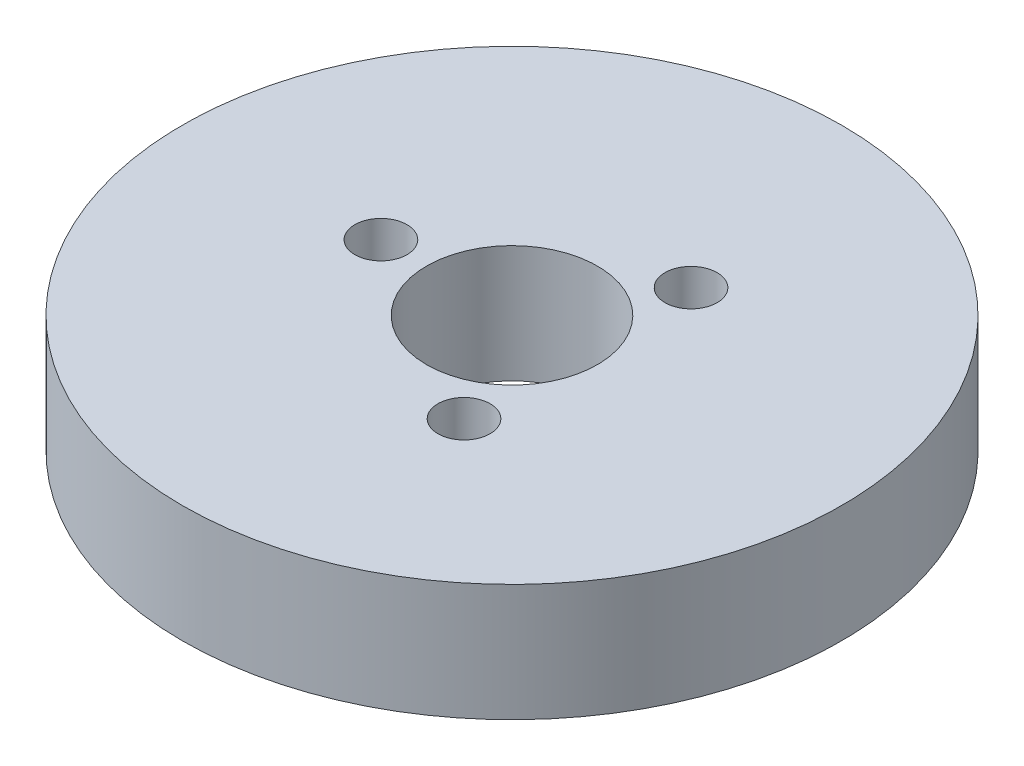
ISO-10303-21;
HEADER;
FILE_DESCRIPTION(('STEP AP214'),'2;1');
FILE_NAME('part.step','',(''),(''),'','','');
FILE_SCHEMA(('AUTOMOTIVE_DESIGN { 1 0 10303 214 1 1 1 1 }'));
ENDSEC;
DATA;
#1=APPLICATION_CONTEXT('core data for automotive mechanical design processes');
#2=APPLICATION_PROTOCOL_DEFINITION('international standard','automotive_design',2000,#1);
#3=PRODUCT_CONTEXT('',#1,'mechanical');
#4=PRODUCT('Part','Part','',(#3));
#5=PRODUCT_RELATED_PRODUCT_CATEGORY('part','',(#4));
#6=PRODUCT_DEFINITION_FORMATION('','',#4);
#7=PRODUCT_DEFINITION_CONTEXT('part definition',#1,'design');
#8=PRODUCT_DEFINITION('design','',#6,#7);
#9=PRODUCT_DEFINITION_SHAPE('','',#8);
#10=(LENGTH_UNIT() NAMED_UNIT(*) SI_UNIT(.MILLI.,.METRE.));
#11=(NAMED_UNIT(*) PLANE_ANGLE_UNIT() SI_UNIT($,.RADIAN.));
#12=(NAMED_UNIT(*) SI_UNIT($,.STERADIAN.) SOLID_ANGLE_UNIT());
#13=UNCERTAINTY_MEASURE_WITH_UNIT(LENGTH_MEASURE(1.E-05),#10,'distance_accuracy_value','');
#14=(GEOMETRIC_REPRESENTATION_CONTEXT(3) GLOBAL_UNCERTAINTY_ASSIGNED_CONTEXT((#13)) GLOBAL_UNIT_ASSIGNED_CONTEXT((#10,
#11,#12)) REPRESENTATION_CONTEXT('',''));
#15=CARTESIAN_POINT('',(0.,0.,0.));
#16=DIRECTION('',(0.,0.,1.));
#17=DIRECTION('',(1.,0.,0.));
#18=AXIS2_PLACEMENT_3D('',#15,#16,#17);
#19=CARTESIAN_POINT('',(0.,24.,0.));
#20=DIRECTION('',(0.,-1.,0.));
#21=DIRECTION('',(0.,0.,-1.));
#22=AXIS2_PLACEMENT_3D('',#19,#20,#21);
#23=CYLINDRICAL_SURFACE('',#22,67.5);
#24=CARTESIAN_POINT('',(0.,24.,0.));
#25=DIRECTION('',(0.,1.,0.));
#26=DIRECTION('',(0.,0.,1.));
#27=AXIS2_PLACEMENT_3D('',#24,#25,#26);
#28=CIRCLE('',#27,67.5);
#29=CARTESIAN_POINT('',(0.,24.,67.5));
#30=VERTEX_POINT('',#29);
#31=EDGE_CURVE('E10',#30,#30,#28,.T.);
#32=ORIENTED_EDGE('',*,*,#31,.F.);
#33=EDGE_LOOP('',(#32));
#34=FACE_BOUND('',#33,.T.);
#35=CARTESIAN_POINT('',(0.,0.,0.));
#36=DIRECTION('',(0.,1.,0.));
#37=DIRECTION('',(0.,0.,1.));
#38=AXIS2_PLACEMENT_3D('',#35,#36,#37);
#39=CIRCLE('',#38,67.5);
#40=CARTESIAN_POINT('',(0.,0.,67.5));
#41=VERTEX_POINT('',#40);
#42=EDGE_CURVE('E37',#41,#41,#39,.T.);
#43=ORIENTED_EDGE('',*,*,#42,.T.);
#44=EDGE_LOOP('',(#43));
#45=FACE_BOUND('',#44,.T.);
#46=ADVANCED_FACE('F40',(#34,#45),#23,.T.);
#47=CARTESIAN_POINT('',(0.,24.,0.));
#48=DIRECTION('',(0.,1.,0.));
#49=DIRECTION('',(0.,0.,1.));
#50=AXIS2_PLACEMENT_3D('',#47,#48,#49);
#51=PLANE('',#50);
#52=CARTESIAN_POINT('',(13.4233599657351,24.,23.249941468939));
#53=DIRECTION('',(0.,1.,0.));
#54=DIRECTION('',(0.866025403784436,0.,-0.500000000000004));
#55=AXIS2_PLACEMENT_3D('',#52,#53,#54);
#56=CIRCLE('',#55,5.33883704182895);
#57=CARTESIAN_POINT('',(18.0469284706244,24.,20.5805229480245));
#58=VERTEX_POINT('',#57);
#59=EDGE_CURVE('E70',#58,#58,#56,.T.);
#60=ORIENTED_EDGE('',*,*,#59,.F.);
#61=EDGE_LOOP('',(#60));
#62=FACE_BOUND('',#61,.T.);
#63=CARTESIAN_POINT('',(13.4233599657348,24.,-23.2499414689392));
#64=DIRECTION('',(0.,1.,0.));
#65=DIRECTION('',(-0.866025403784443,0.,-0.499999999999992));
#66=AXIS2_PLACEMENT_3D('',#63,#64,#65);
#67=CIRCLE('',#66,5.33883704182895);
#68=CARTESIAN_POINT('',(8.79979146084556,24.,-25.9193599898537));
#69=VERTEX_POINT('',#68);
#70=EDGE_CURVE('E61',#69,#69,#67,.T.);
#71=ORIENTED_EDGE('',*,*,#70,.F.);
#72=EDGE_LOOP('',(#71));
#73=FACE_BOUND('',#72,.T.);
#74=CARTESIAN_POINT('',(-26.8467199314701,24.,0.));
#75=DIRECTION('',(0.,1.,0.));
#76=DIRECTION('',(0.,0.,1.));
#77=AXIS2_PLACEMENT_3D('',#74,#75,#76);
#78=CIRCLE('',#77,5.33883704182895);
#79=CARTESIAN_POINT('',(-26.8467199314701,24.,5.33883704182895));
#80=VERTEX_POINT('',#79);
#81=EDGE_CURVE('E54',#80,#80,#78,.T.);
#82=ORIENTED_EDGE('',*,*,#81,.F.);
#83=EDGE_LOOP('',(#82));
#84=FACE_BOUND('',#83,.T.);
#85=CARTESIAN_POINT('',(0.,24.,0.));
#86=DIRECTION('',(0.,1.,0.));
#87=DIRECTION('',(0.,0.,1.));
#88=AXIS2_PLACEMENT_3D('',#85,#86,#87);
#89=CIRCLE('',#88,17.5);
#90=CARTESIAN_POINT('',(0.,24.,17.5));
#91=VERTEX_POINT('',#90);
#92=EDGE_CURVE('E50',#91,#91,#89,.T.);
#93=ORIENTED_EDGE('',*,*,#92,.F.);
#94=EDGE_LOOP('',(#93));
#95=FACE_BOUND('',#94,.T.);
#96=ORIENTED_EDGE('',*,*,#31,.T.);
#97=EDGE_LOOP('',(#96));
#98=FACE_BOUND('',#97,.T.);
#99=ADVANCED_FACE('F85',(#62,#73,#84,#95,#98),#51,.T.);
#100=CARTESIAN_POINT('',(0.,0.,0.));
#101=DIRECTION('',(0.,1.,0.));
#102=DIRECTION('',(0.,0.,1.));
#103=AXIS2_PLACEMENT_3D('',#100,#101,#102);
#104=PLANE('',#103);
#105=CARTESIAN_POINT('',(0.,0.,0.));
#106=DIRECTION('',(0.,1.,0.));
#107=DIRECTION('',(0.,0.,1.));
#108=AXIS2_PLACEMENT_3D('',#105,#106,#107);
#109=CIRCLE('',#108,17.5);
#110=CARTESIAN_POINT('',(0.,0.,17.5));
#111=VERTEX_POINT('',#110);
#112=EDGE_CURVE('E47',#111,#111,#109,.T.);
#113=ORIENTED_EDGE('',*,*,#112,.T.);
#114=EDGE_LOOP('',(#113));
#115=FACE_BOUND('',#114,.T.);
#116=ORIENTED_EDGE('',*,*,#42,.F.);
#117=EDGE_LOOP('',(#116));
#118=FACE_BOUND('',#117,.T.);
#119=ADVANCED_FACE('F84',(#115,#118),#104,.F.);
#120=CARTESIAN_POINT('',(0.,24.,0.));
#121=DIRECTION('',(0.,-1.,0.));
#122=DIRECTION('',(0.,0.,-1.));
#123=AXIS2_PLACEMENT_3D('',#120,#121,#122);
#124=CYLINDRICAL_SURFACE('',#123,17.5);
#125=ORIENTED_EDGE('',*,*,#92,.T.);
#126=EDGE_LOOP('',(#125));
#127=FACE_BOUND('',#126,.T.);
#128=ORIENTED_EDGE('',*,*,#112,.F.);
#129=EDGE_LOOP('',(#128));
#130=FACE_BOUND('',#129,.T.);
#131=ADVANCED_FACE('F91',(#127,#130),#124,.F.);
#132=CARTESIAN_POINT('',(-26.8467199314701,8.25282690632019,0.));
#133=DIRECTION('',(0.,1.,0.));
#134=DIRECTION('',(0.,0.,1.));
#135=AXIS2_PLACEMENT_3D('',#132,#133,#134);
#136=CYLINDRICAL_SURFACE('',#135,5.33883704182895);
#137=CARTESIAN_POINT('',(-26.8467199314701,8.25282690632019,0.));
#138=DIRECTION('',(0.,1.,0.));
#139=DIRECTION('',(0.,0.,1.));
#140=AXIS2_PLACEMENT_3D('',#137,#138,#139);
#141=CIRCLE('',#140,5.33883704182895);
#142=CARTESIAN_POINT('',(-26.8467199314701,8.25282690632019,5.33883704182895));
#143=VERTEX_POINT('',#142);
#144=EDGE_CURVE('E55',#143,#143,#141,.T.);
#145=ORIENTED_EDGE('',*,*,#144,.F.);
#146=EDGE_LOOP('',(#145));
#147=FACE_BOUND('',#146,.T.);
#148=ORIENTED_EDGE('',*,*,#81,.T.);
#149=EDGE_LOOP('',(#148));
#150=FACE_BOUND('',#149,.T.);
#151=ADVANCED_FACE('F96',(#147,#150),#136,.F.);
#152=CARTESIAN_POINT('',(-26.8467199314701,8.25282690632019,0.));
#153=DIRECTION('',(0.,1.,0.));
#154=DIRECTION('',(0.,0.,1.));
#155=AXIS2_PLACEMENT_3D('',#152,#153,#154);
#156=PLANE('',#155);
#157=ORIENTED_EDGE('',*,*,#144,.T.);
#158=EDGE_LOOP('',(#157));
#159=FACE_BOUND('',#158,.T.);
#160=ADVANCED_FACE('F127',(#159),#156,.T.);
#161=CARTESIAN_POINT('',(13.4233599657348,8.25282690632019,-23.2499414689392));
#162=DIRECTION('',(0.,1.,0.));
#163=DIRECTION('',(0.,0.,1.));
#164=AXIS2_PLACEMENT_3D('',#161,#162,#163);
#165=CYLINDRICAL_SURFACE('',#164,5.33883704182895);
#166=CARTESIAN_POINT('',(13.4233599657348,8.25282690632019,-23.2499414689392));
#167=DIRECTION('',(0.,1.,0.));
#168=DIRECTION('',(-0.866025403784443,0.,-0.499999999999992));
#169=AXIS2_PLACEMENT_3D('',#166,#167,#168);
#170=CIRCLE('',#169,5.33883704182895);
#171=CARTESIAN_POINT('',(8.79979146084556,8.25282690632019,-25.9193599898537));
#172=VERTEX_POINT('',#171);
#173=EDGE_CURVE('E63',#172,#172,#170,.T.);
#174=ORIENTED_EDGE('',*,*,#173,.F.);
#175=EDGE_LOOP('',(#174));
#176=FACE_BOUND('',#175,.T.);
#177=ORIENTED_EDGE('',*,*,#70,.T.);
#178=EDGE_LOOP('',(#177));
#179=FACE_BOUND('',#178,.T.);
#180=ADVANCED_FACE('F133',(#176,#179),#165,.F.);
#181=CARTESIAN_POINT('',(13.4233599657348,8.25282690632019,-23.2499414689392));
#182=DIRECTION('',(0.,1.,0.));
#183=DIRECTION('',(-0.866025403784443,0.,-0.499999999999992));
#184=AXIS2_PLACEMENT_3D('',#181,#182,#183);
#185=PLANE('',#184);
#186=ORIENTED_EDGE('',*,*,#173,.T.);
#187=EDGE_LOOP('',(#186));
#188=FACE_BOUND('',#187,.T.);
#189=ADVANCED_FACE('F77',(#188),#185,.T.);
#190=CARTESIAN_POINT('',(13.4233599657351,8.25282690632019,23.249941468939));
#191=DIRECTION('',(0.,1.,0.));
#192=DIRECTION('',(0.,0.,1.));
#193=AXIS2_PLACEMENT_3D('',#190,#191,#192);
#194=CYLINDRICAL_SURFACE('',#193,5.33883704182895);
#195=CARTESIAN_POINT('',(13.4233599657351,8.25282690632019,23.249941468939));
#196=DIRECTION('',(0.,1.,0.));
#197=DIRECTION('',(0.866025403784436,0.,-0.500000000000004));
#198=AXIS2_PLACEMENT_3D('',#195,#196,#197);
#199=CIRCLE('',#198,5.33883704182895);
#200=CARTESIAN_POINT('',(18.0469284706244,8.25282690632019,20.5805229480245));
#201=VERTEX_POINT('',#200);
#202=EDGE_CURVE('E59',#201,#201,#199,.T.);
#203=ORIENTED_EDGE('',*,*,#202,.F.);
#204=EDGE_LOOP('',(#203));
#205=FACE_BOUND('',#204,.T.);
#206=ORIENTED_EDGE('',*,*,#59,.T.);
#207=EDGE_LOOP('',(#206));
#208=FACE_BOUND('',#207,.T.);
#209=ADVANCED_FACE('F73',(#205,#208),#194,.F.);
#210=CARTESIAN_POINT('',(13.4233599657351,8.25282690632019,23.249941468939));
#211=DIRECTION('',(0.,1.,0.));
#212=DIRECTION('',(0.866025403784436,0.,-0.500000000000004));
#213=AXIS2_PLACEMENT_3D('',#210,#211,#212);
#214=PLANE('',#213);
#215=ORIENTED_EDGE('',*,*,#202,.T.);
#216=EDGE_LOOP('',(#215));
#217=FACE_BOUND('',#216,.T.);
#218=ADVANCED_FACE('F71',(#217),#214,.T.);
#219=CLOSED_SHELL('',(#46,#99,#119,#131,#151,#160,#180,#189,#209,#218));
#220=MANIFOLD_SOLID_BREP('B2',#219);
#221=ADVANCED_BREP_SHAPE_REPRESENTATION('',(#18,#220),#14);
#222=SHAPE_DEFINITION_REPRESENTATION(#9,#221);
ENDSEC;
END-ISO-10303-21;
